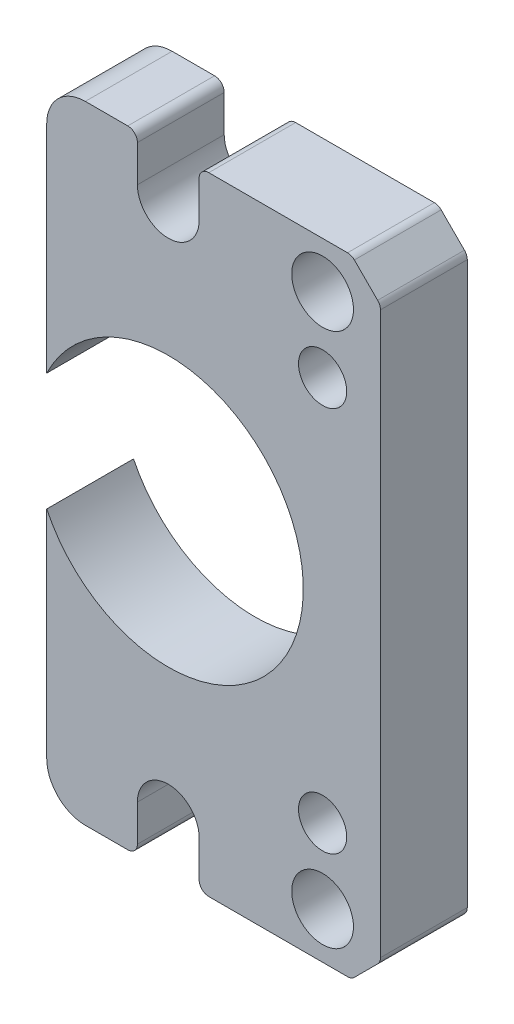
ISO-10303-21;
HEADER;
FILE_DESCRIPTION(('STEP AP214'),'2;1');
FILE_NAME('part.step','',(''),(''),'','','');
FILE_SCHEMA(('AUTOMOTIVE_DESIGN { 1 0 10303 214 1 1 1 1 }'));
ENDSEC;
DATA;
#1=APPLICATION_CONTEXT('core data for automotive mechanical design processes');
#2=APPLICATION_PROTOCOL_DEFINITION('international standard','automotive_design',2000,#1);
#3=PRODUCT_CONTEXT('',#1,'mechanical');
#4=PRODUCT('Part','Part','',(#3));
#5=PRODUCT_RELATED_PRODUCT_CATEGORY('part','',(#4));
#6=PRODUCT_DEFINITION_FORMATION('','',#4);
#7=PRODUCT_DEFINITION_CONTEXT('part definition',#1,'design');
#8=PRODUCT_DEFINITION('design','',#6,#7);
#9=PRODUCT_DEFINITION_SHAPE('','',#8);
#10=(LENGTH_UNIT() NAMED_UNIT(*) SI_UNIT(.MILLI.,.METRE.));
#11=(NAMED_UNIT(*) PLANE_ANGLE_UNIT() SI_UNIT($,.RADIAN.));
#12=(NAMED_UNIT(*) SI_UNIT($,.STERADIAN.) SOLID_ANGLE_UNIT());
#13=UNCERTAINTY_MEASURE_WITH_UNIT(LENGTH_MEASURE(1.E-05),#10,'distance_accuracy_value','');
#14=(GEOMETRIC_REPRESENTATION_CONTEXT(3) GLOBAL_UNCERTAINTY_ASSIGNED_CONTEXT((#13)) GLOBAL_UNIT_ASSIGNED_CONTEXT((#10,
#11,#12)) REPRESENTATION_CONTEXT('',''));
#15=CARTESIAN_POINT('',(0.,0.,0.));
#16=DIRECTION('',(0.,0.,1.));
#17=DIRECTION('',(1.,0.,0.));
#18=AXIS2_PLACEMENT_3D('',#15,#16,#17);
#19=CARTESIAN_POINT('',(10.5,-14.5428932188134,0.));
#20=DIRECTION('',(0.,0.,-1.));
#21=DIRECTION('',(-1.,0.,0.));
#22=AXIS2_PLACEMENT_3D('',#19,#20,#21);
#23=CYLINDRICAL_SURFACE('',#22,0.500000000000017);
#24=CARTESIAN_POINT('',(10.5,-14.5428932188134,-4.5));
#25=DIRECTION('',(0.,0.,-1.));
#26=DIRECTION('',(-1.,0.,0.));
#27=AXIS2_PLACEMENT_3D('',#24,#25,#26);
#28=CIRCLE('',#27,0.500000000000017);
#29=CARTESIAN_POINT('',(11.,-14.5428932188134,-4.5));
#30=VERTEX_POINT('',#29);
#31=CARTESIAN_POINT('',(10.8535533905933,-14.8964466094067,-4.5));
#32=VERTEX_POINT('',#31);
#33=EDGE_CURVE('E257',#30,#32,#28,.T.);
#34=ORIENTED_EDGE('',*,*,#33,.F.);
#35=DIRECTION('',(0.,0.,-1.));
#36=VECTOR('',#35,1.);
#37=CARTESIAN_POINT('',(11.,-14.5428932188134,0.));
#38=LINE('',#37,#36);
#39=CARTESIAN_POINT('',(11.,-14.5428932188134,0.));
#40=VERTEX_POINT('',#39);
#41=EDGE_CURVE('E214',#40,#30,#38,.T.);
#42=ORIENTED_EDGE('',*,*,#41,.F.);
#43=CARTESIAN_POINT('',(10.5,-14.5428932188134,0.));
#44=DIRECTION('',(0.,0.,-1.));
#45=DIRECTION('',(-1.,0.,0.));
#46=AXIS2_PLACEMENT_3D('',#43,#44,#45);
#47=CIRCLE('',#46,0.500000000000017);
#48=CARTESIAN_POINT('',(10.8535533905933,-14.8964466094067,0.));
#49=VERTEX_POINT('',#48);
#50=EDGE_CURVE('E260',#40,#49,#47,.T.);
#51=ORIENTED_EDGE('',*,*,#50,.T.);
#52=DIRECTION('',(0.,0.,-1.));
#53=VECTOR('',#52,1.);
#54=CARTESIAN_POINT('',(10.8535533905933,-14.8964466094067,0.));
#55=LINE('',#54,#53);
#56=EDGE_CURVE('E323',#49,#32,#55,.T.);
#57=ORIENTED_EDGE('',*,*,#56,.T.);
#58=EDGE_LOOP('',(#34,#42,#51,#57));
#59=FACE_BOUND('',#58,.T.);
#60=ADVANCED_FACE('F34',(#59),#23,.T.);
#61=CARTESIAN_POINT('',(11.,14.5428932188134,0.));
#62=DIRECTION('',(1.,0.,0.));
#63=DIRECTION('',(0.,0.,-1.));
#64=AXIS2_PLACEMENT_3D('',#61,#62,#63);
#65=PLANE('',#64);
#66=DIRECTION('',(0.,-1.,0.));
#67=VECTOR('',#66,1.);
#68=CARTESIAN_POINT('',(11.,14.5428932188134,-4.5));
#69=LINE('',#68,#67);
#70=CARTESIAN_POINT('',(11.,14.5428932188134,-4.5));
#71=VERTEX_POINT('',#70);
#72=EDGE_CURVE('E264',#71,#30,#69,.T.);
#73=ORIENTED_EDGE('',*,*,#72,.F.);
#74=DIRECTION('',(0.,0.,-1.));
#75=VECTOR('',#74,1.);
#76=CARTESIAN_POINT('',(11.,14.5428932188134,0.));
#77=LINE('',#76,#75);
#78=CARTESIAN_POINT('',(11.,14.5428932188134,0.));
#79=VERTEX_POINT('',#78);
#80=EDGE_CURVE('E385',#79,#71,#77,.T.);
#81=ORIENTED_EDGE('',*,*,#80,.F.);
#82=DIRECTION('',(0.,-1.,0.));
#83=VECTOR('',#82,1.);
#84=CARTESIAN_POINT('',(11.,14.5428932188134,0.));
#85=LINE('',#84,#83);
#86=EDGE_CURVE('E320',#79,#40,#85,.T.);
#87=ORIENTED_EDGE('',*,*,#86,.T.);
#88=ORIENTED_EDGE('',*,*,#41,.T.);
#89=EDGE_LOOP('',(#73,#81,#87,#88));
#90=FACE_BOUND('',#89,.T.);
#91=ADVANCED_FACE('F481',(#90),#65,.T.);
#92=CARTESIAN_POINT('',(10.5,14.5428932188134,0.));
#93=DIRECTION('',(0.,0.,-1.));
#94=DIRECTION('',(-1.,0.,0.));
#95=AXIS2_PLACEMENT_3D('',#92,#93,#94);
#96=CYLINDRICAL_SURFACE('',#95,0.500000000000017);
#97=CARTESIAN_POINT('',(10.5,14.5428932188134,-4.5));
#98=DIRECTION('',(0.,0.,-1.));
#99=DIRECTION('',(-1.,0.,0.));
#100=AXIS2_PLACEMENT_3D('',#97,#98,#99);
#101=CIRCLE('',#100,0.500000000000017);
#102=CARTESIAN_POINT('',(10.8535533905933,14.8964466094067,-4.5));
#103=VERTEX_POINT('',#102);
#104=EDGE_CURVE('E379',#103,#71,#101,.T.);
#105=ORIENTED_EDGE('',*,*,#104,.F.);
#106=DIRECTION('',(0.,0.,-1.));
#107=VECTOR('',#106,1.);
#108=CARTESIAN_POINT('',(10.8535533905933,14.8964466094067,0.));
#109=LINE('',#108,#107);
#110=CARTESIAN_POINT('',(10.8535533905933,14.8964466094067,0.));
#111=VERTEX_POINT('',#110);
#112=EDGE_CURVE('E387',#111,#103,#109,.T.);
#113=ORIENTED_EDGE('',*,*,#112,.F.);
#114=CARTESIAN_POINT('',(10.5,14.5428932188134,0.));
#115=DIRECTION('',(0.,0.,-1.));
#116=DIRECTION('',(-1.,0.,0.));
#117=AXIS2_PLACEMENT_3D('',#114,#115,#116);
#118=CIRCLE('',#117,0.500000000000017);
#119=EDGE_CURVE('E317',#111,#79,#118,.T.);
#120=ORIENTED_EDGE('',*,*,#119,.T.);
#121=ORIENTED_EDGE('',*,*,#80,.T.);
#122=EDGE_LOOP('',(#105,#113,#120,#121));
#123=FACE_BOUND('',#122,.T.);
#124=ADVANCED_FACE('F478',(#123),#96,.T.);
#125=CARTESIAN_POINT('',(9.64644660940672,16.1035533905933,0.));
#126=DIRECTION('',(0.707106781186554,0.707106781186541,0.));
#127=DIRECTION('',(-0.707106781186541,0.707106781186554,0.));
#128=AXIS2_PLACEMENT_3D('',#125,#126,#127);
#129=PLANE('',#128);
#130=DIRECTION('',(0.707106781186541,-0.707106781186554,0.));
#131=VECTOR('',#130,1.);
#132=CARTESIAN_POINT('',(9.64644660940672,16.1035533905933,-4.5));
#133=LINE('',#132,#131);
#134=CARTESIAN_POINT('',(9.64644660940672,16.1035533905933,-4.5));
#135=VERTEX_POINT('',#134);
#136=EDGE_CURVE('E376',#135,#103,#133,.T.);
#137=ORIENTED_EDGE('',*,*,#136,.F.);
#138=DIRECTION('',(0.,0.,-1.));
#139=VECTOR('',#138,1.);
#140=CARTESIAN_POINT('',(9.64644660940672,16.1035533905933,0.));
#141=LINE('',#140,#139);
#142=CARTESIAN_POINT('',(9.64644660940672,16.1035533905933,0.));
#143=VERTEX_POINT('',#142);
#144=EDGE_CURVE('E389',#143,#135,#141,.T.);
#145=ORIENTED_EDGE('',*,*,#144,.F.);
#146=DIRECTION('',(0.707106781186541,-0.707106781186554,0.));
#147=VECTOR('',#146,1.);
#148=CARTESIAN_POINT('',(9.64644660940672,16.1035533905933,0.));
#149=LINE('',#148,#147);
#150=EDGE_CURVE('E314',#143,#111,#149,.T.);
#151=ORIENTED_EDGE('',*,*,#150,.T.);
#152=ORIENTED_EDGE('',*,*,#112,.T.);
#153=EDGE_LOOP('',(#137,#145,#151,#152));
#154=FACE_BOUND('',#153,.T.);
#155=ADVANCED_FACE('F474',(#154),#129,.T.);
#156=CARTESIAN_POINT('',(9.29289321881345,15.75,0.));
#157=DIRECTION('',(0.,0.,-1.));
#158=DIRECTION('',(-1.,0.,0.));
#159=AXIS2_PLACEMENT_3D('',#156,#157,#158);
#160=CYLINDRICAL_SURFACE('',#159,0.500000000000008);
#161=CARTESIAN_POINT('',(9.29289321881345,15.75,-4.5));
#162=DIRECTION('',(0.,0.,-1.));
#163=DIRECTION('',(-1.,0.,0.));
#164=AXIS2_PLACEMENT_3D('',#161,#162,#163);
#165=CIRCLE('',#164,0.500000000000008);
#166=CARTESIAN_POINT('',(9.29289321881345,16.25,-4.5));
#167=VERTEX_POINT('',#166);
#168=EDGE_CURVE('E373',#167,#135,#165,.T.);
#169=ORIENTED_EDGE('',*,*,#168,.F.);
#170=DIRECTION('',(0.,0.,-1.));
#171=VECTOR('',#170,1.);
#172=CARTESIAN_POINT('',(9.29289321881345,16.25,0.));
#173=LINE('',#172,#171);
#174=CARTESIAN_POINT('',(9.29289321881345,16.25,0.));
#175=VERTEX_POINT('',#174);
#176=EDGE_CURVE('E391',#175,#167,#173,.T.);
#177=ORIENTED_EDGE('',*,*,#176,.F.);
#178=CARTESIAN_POINT('',(9.29289321881345,15.75,0.));
#179=DIRECTION('',(0.,0.,-1.));
#180=DIRECTION('',(-1.,0.,0.));
#181=AXIS2_PLACEMENT_3D('',#178,#179,#180);
#182=CIRCLE('',#181,0.500000000000008);
#183=EDGE_CURVE('E311',#175,#143,#182,.T.);
#184=ORIENTED_EDGE('',*,*,#183,.T.);
#185=ORIENTED_EDGE('',*,*,#144,.T.);
#186=EDGE_LOOP('',(#169,#177,#184,#185));
#187=FACE_BOUND('',#186,.T.);
#188=ADVANCED_FACE('F469',(#187),#160,.T.);
#189=CARTESIAN_POINT('',(2.1,16.25,0.));
#190=DIRECTION('',(0.,1.,0.));
#191=DIRECTION('',(0.,0.,1.));
#192=AXIS2_PLACEMENT_3D('',#189,#190,#191);
#193=PLANE('',#192);
#194=DIRECTION('',(1.,0.,0.));
#195=VECTOR('',#194,1.);
#196=CARTESIAN_POINT('',(2.1,16.25,-4.5));
#197=LINE('',#196,#195);
#198=CARTESIAN_POINT('',(2.1,16.25,-4.5));
#199=VERTEX_POINT('',#198);
#200=EDGE_CURVE('E370',#199,#167,#197,.T.);
#201=ORIENTED_EDGE('',*,*,#200,.F.);
#202=DIRECTION('',(0.,0.,-1.));
#203=VECTOR('',#202,1.);
#204=CARTESIAN_POINT('',(2.1,16.25,0.));
#205=LINE('',#204,#203);
#206=CARTESIAN_POINT('',(2.1,16.25,0.));
#207=VERTEX_POINT('',#206);
#208=EDGE_CURVE('E393',#207,#199,#205,.T.);
#209=ORIENTED_EDGE('',*,*,#208,.F.);
#210=DIRECTION('',(1.,0.,0.));
#211=VECTOR('',#210,1.);
#212=CARTESIAN_POINT('',(2.1,16.25,0.));
#213=LINE('',#212,#211);
#214=EDGE_CURVE('E308',#207,#175,#213,.T.);
#215=ORIENTED_EDGE('',*,*,#214,.T.);
#216=ORIENTED_EDGE('',*,*,#176,.T.);
#217=EDGE_LOOP('',(#201,#209,#215,#216));
#218=FACE_BOUND('',#217,.T.);
#219=ADVANCED_FACE('F465',(#218),#193,.T.);
#220=CARTESIAN_POINT('',(2.1,15.75,0.));
#221=DIRECTION('',(0.,0.,-1.));
#222=DIRECTION('',(-1.,0.,0.));
#223=AXIS2_PLACEMENT_3D('',#220,#221,#222);
#224=CYLINDRICAL_SURFACE('',#223,0.5);
#225=CARTESIAN_POINT('',(2.1,15.75,-4.5));
#226=DIRECTION('',(0.,0.,-1.));
#227=DIRECTION('',(-1.,0.,0.));
#228=AXIS2_PLACEMENT_3D('',#225,#226,#227);
#229=CIRCLE('',#228,0.5);
#230=CARTESIAN_POINT('',(1.6,15.75,-4.5));
#231=VERTEX_POINT('',#230);
#232=EDGE_CURVE('E367',#231,#199,#229,.T.);
#233=ORIENTED_EDGE('',*,*,#232,.F.);
#234=DIRECTION('',(0.,0.,-1.));
#235=VECTOR('',#234,1.);
#236=CARTESIAN_POINT('',(1.6,15.75,0.));
#237=LINE('',#236,#235);
#238=CARTESIAN_POINT('',(1.6,15.75,0.));
#239=VERTEX_POINT('',#238);
#240=EDGE_CURVE('E395',#239,#231,#237,.T.);
#241=ORIENTED_EDGE('',*,*,#240,.F.);
#242=CARTESIAN_POINT('',(2.1,15.75,0.));
#243=DIRECTION('',(0.,0.,-1.));
#244=DIRECTION('',(-1.,0.,0.));
#245=AXIS2_PLACEMENT_3D('',#242,#243,#244);
#246=CIRCLE('',#245,0.5);
#247=EDGE_CURVE('E305',#239,#207,#246,.T.);
#248=ORIENTED_EDGE('',*,*,#247,.T.);
#249=ORIENTED_EDGE('',*,*,#208,.T.);
#250=EDGE_LOOP('',(#233,#241,#248,#249));
#251=FACE_BOUND('',#250,.T.);
#252=ADVANCED_FACE('F461',(#251),#224,.T.);
#253=CARTESIAN_POINT('',(1.6,13.856406460551,0.));
#254=DIRECTION('',(-1.,0.,0.));
#255=DIRECTION('',(0.,0.,1.));
#256=AXIS2_PLACEMENT_3D('',#253,#254,#255);
#257=PLANE('',#256);
#258=DIRECTION('',(0.,1.,0.));
#259=VECTOR('',#258,1.);
#260=CARTESIAN_POINT('',(1.6,13.856406460551,-4.5));
#261=LINE('',#260,#259);
#262=CARTESIAN_POINT('',(1.6,13.856406460551,-4.5));
#263=VERTEX_POINT('',#262);
#264=EDGE_CURVE('E364',#263,#231,#261,.T.);
#265=ORIENTED_EDGE('',*,*,#264,.F.);
#266=DIRECTION('',(0.,0.,-1.));
#267=VECTOR('',#266,1.);
#268=CARTESIAN_POINT('',(1.6,13.856406460551,0.));
#269=LINE('',#268,#267);
#270=CARTESIAN_POINT('',(1.6,13.856406460551,0.));
#271=VERTEX_POINT('',#270);
#272=EDGE_CURVE('E397',#271,#263,#269,.T.);
#273=ORIENTED_EDGE('',*,*,#272,.F.);
#274=DIRECTION('',(0.,1.,0.));
#275=VECTOR('',#274,1.);
#276=CARTESIAN_POINT('',(1.6,13.856406460551,0.));
#277=LINE('',#276,#275);
#278=EDGE_CURVE('E302',#271,#239,#277,.T.);
#279=ORIENTED_EDGE('',*,*,#278,.T.);
#280=ORIENTED_EDGE('',*,*,#240,.T.);
#281=EDGE_LOOP('',(#265,#273,#279,#280));
#282=FACE_BOUND('',#281,.T.);
#283=ADVANCED_FACE('F457',(#282),#257,.T.);
#284=CARTESIAN_POINT('',(0.,13.856406460551,0.));
#285=DIRECTION('',(0.,0.,-1.));
#286=DIRECTION('',(-1.,0.,0.));
#287=AXIS2_PLACEMENT_3D('',#284,#285,#286);
#288=CYLINDRICAL_SURFACE('',#287,1.6);
#289=CARTESIAN_POINT('',(0.,13.856406460551,-4.5));
#290=DIRECTION('',(0.,0.,1.));
#291=DIRECTION('',(1.,0.,0.));
#292=AXIS2_PLACEMENT_3D('',#289,#290,#291);
#293=CIRCLE('',#292,1.6);
#294=CARTESIAN_POINT('',(-1.6,13.856406460551,-4.5));
#295=VERTEX_POINT('',#294);
#296=EDGE_CURVE('E361',#295,#263,#293,.T.);
#297=ORIENTED_EDGE('',*,*,#296,.F.);
#298=DIRECTION('',(0.,0.,-1.));
#299=VECTOR('',#298,1.);
#300=CARTESIAN_POINT('',(-1.6,13.856406460551,0.));
#301=LINE('',#300,#299);
#302=CARTESIAN_POINT('',(-1.6,13.856406460551,0.));
#303=VERTEX_POINT('',#302);
#304=EDGE_CURVE('E399',#303,#295,#301,.T.);
#305=ORIENTED_EDGE('',*,*,#304,.F.);
#306=CARTESIAN_POINT('',(0.,13.856406460551,0.));
#307=DIRECTION('',(0.,0.,1.));
#308=DIRECTION('',(1.,0.,0.));
#309=AXIS2_PLACEMENT_3D('',#306,#307,#308);
#310=CIRCLE('',#309,1.6);
#311=EDGE_CURVE('E299',#303,#271,#310,.T.);
#312=ORIENTED_EDGE('',*,*,#311,.T.);
#313=ORIENTED_EDGE('',*,*,#272,.T.);
#314=EDGE_LOOP('',(#297,#305,#312,#313));
#315=FACE_BOUND('',#314,.T.);
#316=ADVANCED_FACE('F453',(#315),#288,.F.);
#317=CARTESIAN_POINT('',(-1.6,15.75,0.));
#318=DIRECTION('',(1.,0.,0.));
#319=DIRECTION('',(0.,0.,-1.));
#320=AXIS2_PLACEMENT_3D('',#317,#318,#319);
#321=PLANE('',#320);
#322=DIRECTION('',(0.,-1.,0.));
#323=VECTOR('',#322,1.);
#324=CARTESIAN_POINT('',(-1.6,15.75,-4.5));
#325=LINE('',#324,#323);
#326=CARTESIAN_POINT('',(-1.6,15.75,-4.5));
#327=VERTEX_POINT('',#326);
#328=EDGE_CURVE('E358',#327,#295,#325,.T.);
#329=ORIENTED_EDGE('',*,*,#328,.F.);
#330=DIRECTION('',(0.,0.,-1.));
#331=VECTOR('',#330,1.);
#332=CARTESIAN_POINT('',(-1.6,15.75,0.));
#333=LINE('',#332,#331);
#334=CARTESIAN_POINT('',(-1.6,15.75,0.));
#335=VERTEX_POINT('',#334);
#336=EDGE_CURVE('E401',#335,#327,#333,.T.);
#337=ORIENTED_EDGE('',*,*,#336,.F.);
#338=DIRECTION('',(0.,-1.,0.));
#339=VECTOR('',#338,1.);
#340=CARTESIAN_POINT('',(-1.6,15.75,0.));
#341=LINE('',#340,#339);
#342=EDGE_CURVE('E296',#335,#303,#341,.T.);
#343=ORIENTED_EDGE('',*,*,#342,.T.);
#344=ORIENTED_EDGE('',*,*,#304,.T.);
#345=EDGE_LOOP('',(#329,#337,#343,#344));
#346=FACE_BOUND('',#345,.T.);
#347=ADVANCED_FACE('F451',(#346),#321,.T.);
#348=CARTESIAN_POINT('',(-2.1,15.75,0.));
#349=DIRECTION('',(0.,0.,-1.));
#350=DIRECTION('',(-1.,0.,0.));
#351=AXIS2_PLACEMENT_3D('',#348,#349,#350);
#352=CYLINDRICAL_SURFACE('',#351,0.5);
#353=CARTESIAN_POINT('',(-2.1,15.75,-4.5));
#354=DIRECTION('',(0.,0.,-1.));
#355=DIRECTION('',(-1.,0.,0.));
#356=AXIS2_PLACEMENT_3D('',#353,#354,#355);
#357=CIRCLE('',#356,0.5);
#358=CARTESIAN_POINT('',(-2.1,16.25,-4.5));
#359=VERTEX_POINT('',#358);
#360=EDGE_CURVE('E355',#359,#327,#357,.T.);
#361=ORIENTED_EDGE('',*,*,#360,.F.);
#362=DIRECTION('',(0.,0.,-1.));
#363=VECTOR('',#362,1.);
#364=CARTESIAN_POINT('',(-2.1,16.25,0.));
#365=LINE('',#364,#363);
#366=CARTESIAN_POINT('',(-2.1,16.25,0.));
#367=VERTEX_POINT('',#366);
#368=EDGE_CURVE('E403',#367,#359,#365,.T.);
#369=ORIENTED_EDGE('',*,*,#368,.F.);
#370=CARTESIAN_POINT('',(-2.1,15.75,0.));
#371=DIRECTION('',(0.,0.,-1.));
#372=DIRECTION('',(-1.,0.,0.));
#373=AXIS2_PLACEMENT_3D('',#370,#371,#372);
#374=CIRCLE('',#373,0.5);
#375=EDGE_CURVE('E293',#367,#335,#374,.T.);
#376=ORIENTED_EDGE('',*,*,#375,.T.);
#377=ORIENTED_EDGE('',*,*,#336,.T.);
#378=EDGE_LOOP('',(#361,#369,#376,#377));
#379=FACE_BOUND('',#378,.T.);
#380=ADVANCED_FACE('F445',(#379),#352,.T.);
#381=CARTESIAN_POINT('',(-9.29289321881346,16.25,0.));
#382=DIRECTION('',(0.,1.,0.));
#383=DIRECTION('',(0.,0.,1.));
#384=AXIS2_PLACEMENT_3D('',#381,#382,#383);
#385=PLANE('',#384);
#386=DIRECTION('',(1.,0.,0.));
#387=VECTOR('',#386,1.);
#388=CARTESIAN_POINT('',(-9.29289321881346,16.25,-4.5));
#389=LINE('',#388,#387);
#390=CARTESIAN_POINT('',(-4.30090089148444,16.25,-4.5));
#391=VERTEX_POINT('',#390);
#392=EDGE_CURVE('E353',#391,#359,#389,.T.);
#393=ORIENTED_EDGE('',*,*,#392,.F.);
#394=DIRECTION('',(0.,0.,1.));
#395=VECTOR('',#394,1.);
#396=CARTESIAN_POINT('',(-4.30090089148444,16.25,0.));
#397=LINE('',#396,#395);
#398=CARTESIAN_POINT('',(-4.30090089148444,16.25,0.));
#399=VERTEX_POINT('',#398);
#400=EDGE_CURVE('E42',#391,#399,#397,.T.);
#401=ORIENTED_EDGE('',*,*,#400,.T.);
#402=DIRECTION('',(1.,0.,0.));
#403=VECTOR('',#402,1.);
#404=CARTESIAN_POINT('',(-9.29289321881346,16.25,0.));
#405=LINE('',#404,#403);
#406=EDGE_CURVE('E291',#399,#367,#405,.T.);
#407=ORIENTED_EDGE('',*,*,#406,.T.);
#408=ORIENTED_EDGE('',*,*,#368,.T.);
#409=EDGE_LOOP('',(#393,#401,#407,#408));
#410=FACE_BOUND('',#409,.T.);
#411=ADVANCED_FACE('F437',(#410),#385,.T.);
#412=CARTESIAN_POINT('',(-2.1,-16.25,0.));
#413=DIRECTION('',(0.,-1.,0.));
#414=DIRECTION('',(0.,0.,-1.));
#415=AXIS2_PLACEMENT_3D('',#412,#413,#414);
#416=PLANE('',#415);
#417=DIRECTION('',(-1.,0.,0.));
#418=VECTOR('',#417,1.);
#419=CARTESIAN_POINT('',(-2.1,-16.25,0.));
#420=LINE('',#419,#418);
#421=CARTESIAN_POINT('',(-2.1,-16.25,0.));
#422=VERTEX_POINT('',#421);
#423=CARTESIAN_POINT('',(-4.30090089148444,-16.25,0.));
#424=VERTEX_POINT('',#423);
#425=EDGE_CURVE('E288',#422,#424,#420,.T.);
#426=ORIENTED_EDGE('',*,*,#425,.T.);
#427=DIRECTION('',(0.,0.,1.));
#428=VECTOR('',#427,1.);
#429=CARTESIAN_POINT('',(-4.30090089148444,-16.25,-4.5));
#430=LINE('',#429,#428);
#431=CARTESIAN_POINT('',(-4.30090089148444,-16.25,-4.5));
#432=VERTEX_POINT('',#431);
#433=EDGE_CURVE('E430',#424,#432,#430,.F.);
#434=ORIENTED_EDGE('',*,*,#433,.T.);
#435=DIRECTION('',(-1.,0.,0.));
#436=VECTOR('',#435,1.);
#437=CARTESIAN_POINT('',(-2.1,-16.25,-4.5));
#438=LINE('',#437,#436);
#439=CARTESIAN_POINT('',(-2.1,-16.25,-4.5));
#440=VERTEX_POINT('',#439);
#441=EDGE_CURVE('E350',#440,#432,#438,.T.);
#442=ORIENTED_EDGE('',*,*,#441,.F.);
#443=DIRECTION('',(0.,0.,-1.));
#444=VECTOR('',#443,1.);
#445=CARTESIAN_POINT('',(-2.1,-16.25,0.));
#446=LINE('',#445,#444);
#447=EDGE_CURVE('E406',#422,#440,#446,.T.);
#448=ORIENTED_EDGE('',*,*,#447,.F.);
#449=EDGE_LOOP('',(#426,#434,#442,#448));
#450=FACE_BOUND('',#449,.T.);
#451=ADVANCED_FACE('F555',(#450),#416,.T.);
#452=CARTESIAN_POINT('',(-2.1,-15.75,0.));
#453=DIRECTION('',(0.,0.,-1.));
#454=DIRECTION('',(-1.,0.,0.));
#455=AXIS2_PLACEMENT_3D('',#452,#453,#454);
#456=CYLINDRICAL_SURFACE('',#455,0.5);
#457=CARTESIAN_POINT('',(-2.1,-15.75,-4.5));
#458=DIRECTION('',(0.,0.,-1.));
#459=DIRECTION('',(-1.,0.,0.));
#460=AXIS2_PLACEMENT_3D('',#457,#458,#459);
#461=CIRCLE('',#460,0.5);
#462=CARTESIAN_POINT('',(-1.6,-15.75,-4.5));
#463=VERTEX_POINT('',#462);
#464=EDGE_CURVE('E347',#463,#440,#461,.T.);
#465=ORIENTED_EDGE('',*,*,#464,.F.);
#466=DIRECTION('',(0.,0.,-1.));
#467=VECTOR('',#466,1.);
#468=CARTESIAN_POINT('',(-1.6,-15.75,0.));
#469=LINE('',#468,#467);
#470=CARTESIAN_POINT('',(-1.6,-15.75,0.));
#471=VERTEX_POINT('',#470);
#472=EDGE_CURVE('E408',#471,#463,#469,.T.);
#473=ORIENTED_EDGE('',*,*,#472,.F.);
#474=CARTESIAN_POINT('',(-2.1,-15.75,0.));
#475=DIRECTION('',(0.,0.,-1.));
#476=DIRECTION('',(-1.,0.,0.));
#477=AXIS2_PLACEMENT_3D('',#474,#475,#476);
#478=CIRCLE('',#477,0.5);
#479=EDGE_CURVE('E285',#471,#422,#478,.T.);
#480=ORIENTED_EDGE('',*,*,#479,.T.);
#481=ORIENTED_EDGE('',*,*,#447,.T.);
#482=EDGE_LOOP('',(#465,#473,#480,#481));
#483=FACE_BOUND('',#482,.T.);
#484=ADVANCED_FACE('F516',(#483),#456,.T.);
#485=CARTESIAN_POINT('',(-1.6,-13.856406460551,0.));
#486=DIRECTION('',(1.,0.,0.));
#487=DIRECTION('',(0.,0.,-1.));
#488=AXIS2_PLACEMENT_3D('',#485,#486,#487);
#489=PLANE('',#488);
#490=DIRECTION('',(0.,-1.,0.));
#491=VECTOR('',#490,1.);
#492=CARTESIAN_POINT('',(-1.6,-13.856406460551,-4.5));
#493=LINE('',#492,#491);
#494=CARTESIAN_POINT('',(-1.6,-13.856406460551,-4.5));
#495=VERTEX_POINT('',#494);
#496=EDGE_CURVE('E344',#495,#463,#493,.T.);
#497=ORIENTED_EDGE('',*,*,#496,.F.);
#498=DIRECTION('',(0.,0.,-1.));
#499=VECTOR('',#498,1.);
#500=CARTESIAN_POINT('',(-1.6,-13.856406460551,0.));
#501=LINE('',#500,#499);
#502=CARTESIAN_POINT('',(-1.6,-13.856406460551,0.));
#503=VERTEX_POINT('',#502);
#504=EDGE_CURVE('E410',#503,#495,#501,.T.);
#505=ORIENTED_EDGE('',*,*,#504,.F.);
#506=DIRECTION('',(0.,-1.,0.));
#507=VECTOR('',#506,1.);
#508=CARTESIAN_POINT('',(-1.6,-13.856406460551,0.));
#509=LINE('',#508,#507);
#510=EDGE_CURVE('E282',#503,#471,#509,.T.);
#511=ORIENTED_EDGE('',*,*,#510,.T.);
#512=ORIENTED_EDGE('',*,*,#472,.T.);
#513=EDGE_LOOP('',(#497,#505,#511,#512));
#514=FACE_BOUND('',#513,.T.);
#515=ADVANCED_FACE('F512',(#514),#489,.T.);
#516=CARTESIAN_POINT('',(0.,-13.856406460551,0.));
#517=DIRECTION('',(0.,0.,-1.));
#518=DIRECTION('',(-1.,0.,0.));
#519=AXIS2_PLACEMENT_3D('',#516,#517,#518);
#520=CYLINDRICAL_SURFACE('',#519,1.6);
#521=CARTESIAN_POINT('',(0.,-13.856406460551,-4.5));
#522=DIRECTION('',(0.,0.,1.));
#523=DIRECTION('',(1.,0.,0.));
#524=AXIS2_PLACEMENT_3D('',#521,#522,#523);
#525=CIRCLE('',#524,1.6);
#526=CARTESIAN_POINT('',(1.6,-13.856406460551,-4.5));
#527=VERTEX_POINT('',#526);
#528=EDGE_CURVE('E341',#527,#495,#525,.T.);
#529=ORIENTED_EDGE('',*,*,#528,.F.);
#530=DIRECTION('',(0.,0.,-1.));
#531=VECTOR('',#530,1.);
#532=CARTESIAN_POINT('',(1.6,-13.856406460551,0.));
#533=LINE('',#532,#531);
#534=CARTESIAN_POINT('',(1.6,-13.856406460551,0.));
#535=VERTEX_POINT('',#534);
#536=EDGE_CURVE('E412',#535,#527,#533,.T.);
#537=ORIENTED_EDGE('',*,*,#536,.F.);
#538=CARTESIAN_POINT('',(0.,-13.856406460551,0.));
#539=DIRECTION('',(0.,0.,1.));
#540=DIRECTION('',(1.,0.,0.));
#541=AXIS2_PLACEMENT_3D('',#538,#539,#540);
#542=CIRCLE('',#541,1.6);
#543=EDGE_CURVE('E279',#535,#503,#542,.T.);
#544=ORIENTED_EDGE('',*,*,#543,.T.);
#545=ORIENTED_EDGE('',*,*,#504,.T.);
#546=EDGE_LOOP('',(#529,#537,#544,#545));
#547=FACE_BOUND('',#546,.T.);
#548=ADVANCED_FACE('F508',(#547),#520,.F.);
#549=CARTESIAN_POINT('',(1.6,-15.75,0.));
#550=DIRECTION('',(-1.,0.,0.));
#551=DIRECTION('',(0.,0.,1.));
#552=AXIS2_PLACEMENT_3D('',#549,#550,#551);
#553=PLANE('',#552);
#554=DIRECTION('',(0.,1.,0.));
#555=VECTOR('',#554,1.);
#556=CARTESIAN_POINT('',(1.6,-15.75,-4.5));
#557=LINE('',#556,#555);
#558=CARTESIAN_POINT('',(1.6,-15.75,-4.5));
#559=VERTEX_POINT('',#558);
#560=EDGE_CURVE('E338',#559,#527,#557,.T.);
#561=ORIENTED_EDGE('',*,*,#560,.F.);
#562=DIRECTION('',(0.,0.,-1.));
#563=VECTOR('',#562,1.);
#564=CARTESIAN_POINT('',(1.6,-15.75,0.));
#565=LINE('',#564,#563);
#566=CARTESIAN_POINT('',(1.6,-15.75,0.));
#567=VERTEX_POINT('',#566);
#568=EDGE_CURVE('E414',#567,#559,#565,.T.);
#569=ORIENTED_EDGE('',*,*,#568,.F.);
#570=DIRECTION('',(0.,1.,0.));
#571=VECTOR('',#570,1.);
#572=CARTESIAN_POINT('',(1.6,-15.75,0.));
#573=LINE('',#572,#571);
#574=EDGE_CURVE('E276',#567,#535,#573,.T.);
#575=ORIENTED_EDGE('',*,*,#574,.T.);
#576=ORIENTED_EDGE('',*,*,#536,.T.);
#577=EDGE_LOOP('',(#561,#569,#575,#576));
#578=FACE_BOUND('',#577,.T.);
#579=ADVANCED_FACE('F504',(#578),#553,.T.);
#580=CARTESIAN_POINT('',(2.1,-15.75,0.));
#581=DIRECTION('',(0.,0.,-1.));
#582=DIRECTION('',(-1.,0.,0.));
#583=AXIS2_PLACEMENT_3D('',#580,#581,#582);
#584=CYLINDRICAL_SURFACE('',#583,0.5);
#585=CARTESIAN_POINT('',(2.1,-15.75,-4.5));
#586=DIRECTION('',(0.,0.,-1.));
#587=DIRECTION('',(-1.,0.,0.));
#588=AXIS2_PLACEMENT_3D('',#585,#586,#587);
#589=CIRCLE('',#588,0.5);
#590=CARTESIAN_POINT('',(2.1,-16.25,-4.5));
#591=VERTEX_POINT('',#590);
#592=EDGE_CURVE('E335',#591,#559,#589,.T.);
#593=ORIENTED_EDGE('',*,*,#592,.F.);
#594=DIRECTION('',(0.,0.,-1.));
#595=VECTOR('',#594,1.);
#596=CARTESIAN_POINT('',(2.1,-16.25,0.));
#597=LINE('',#596,#595);
#598=CARTESIAN_POINT('',(2.1,-16.25,0.));
#599=VERTEX_POINT('',#598);
#600=EDGE_CURVE('E416',#599,#591,#597,.T.);
#601=ORIENTED_EDGE('',*,*,#600,.F.);
#602=CARTESIAN_POINT('',(2.1,-15.75,0.));
#603=DIRECTION('',(0.,0.,-1.));
#604=DIRECTION('',(-1.,0.,0.));
#605=AXIS2_PLACEMENT_3D('',#602,#603,#604);
#606=CIRCLE('',#605,0.5);
#607=EDGE_CURVE('E273',#599,#567,#606,.T.);
#608=ORIENTED_EDGE('',*,*,#607,.T.);
#609=ORIENTED_EDGE('',*,*,#568,.T.);
#610=EDGE_LOOP('',(#593,#601,#608,#609));
#611=FACE_BOUND('',#610,.T.);
#612=ADVANCED_FACE('F500',(#611),#584,.T.);
#613=CARTESIAN_POINT('',(9.29289321881345,-16.25,0.));
#614=DIRECTION('',(0.,-1.,0.));
#615=DIRECTION('',(0.,0.,-1.));
#616=AXIS2_PLACEMENT_3D('',#613,#614,#615);
#617=PLANE('',#616);
#618=DIRECTION('',(-1.,0.,0.));
#619=VECTOR('',#618,1.);
#620=CARTESIAN_POINT('',(9.29289321881345,-16.25,-4.5));
#621=LINE('',#620,#619);
#622=CARTESIAN_POINT('',(9.29289321881345,-16.25,-4.5));
#623=VERTEX_POINT('',#622);
#624=EDGE_CURVE('E332',#623,#591,#621,.T.);
#625=ORIENTED_EDGE('',*,*,#624,.F.);
#626=DIRECTION('',(0.,0.,-1.));
#627=VECTOR('',#626,1.);
#628=CARTESIAN_POINT('',(9.29289321881345,-16.25,0.));
#629=LINE('',#628,#627);
#630=CARTESIAN_POINT('',(9.29289321881345,-16.25,0.));
#631=VERTEX_POINT('',#630);
#632=EDGE_CURVE('E418',#631,#623,#629,.T.);
#633=ORIENTED_EDGE('',*,*,#632,.F.);
#634=DIRECTION('',(-1.,0.,0.));
#635=VECTOR('',#634,1.);
#636=CARTESIAN_POINT('',(9.29289321881345,-16.25,0.));
#637=LINE('',#636,#635);
#638=EDGE_CURVE('E270',#631,#599,#637,.T.);
#639=ORIENTED_EDGE('',*,*,#638,.T.);
#640=ORIENTED_EDGE('',*,*,#600,.T.);
#641=EDGE_LOOP('',(#625,#633,#639,#640));
#642=FACE_BOUND('',#641,.T.);
#643=ADVANCED_FACE('F496',(#642),#617,.T.);
#644=CARTESIAN_POINT('',(9.29289321881345,-15.75,0.));
#645=DIRECTION('',(0.,0.,-1.));
#646=DIRECTION('',(-1.,0.,0.));
#647=AXIS2_PLACEMENT_3D('',#644,#645,#646);
#648=CYLINDRICAL_SURFACE('',#647,0.500000000000012);
#649=CARTESIAN_POINT('',(9.29289321881345,-15.75,-4.5));
#650=DIRECTION('',(0.,0.,-1.));
#651=DIRECTION('',(-1.,0.,0.));
#652=AXIS2_PLACEMENT_3D('',#649,#650,#651);
#653=CIRCLE('',#652,0.500000000000012);
#654=CARTESIAN_POINT('',(9.64644660940673,-16.1035533905933,-4.5));
#655=VERTEX_POINT('',#654);
#656=EDGE_CURVE('E329',#655,#623,#653,.T.);
#657=ORIENTED_EDGE('',*,*,#656,.F.);
#658=DIRECTION('',(0.,0.,-1.));
#659=VECTOR('',#658,1.);
#660=CARTESIAN_POINT('',(9.64644660940673,-16.1035533905933,0.));
#661=LINE('',#660,#659);
#662=CARTESIAN_POINT('',(9.64644660940673,-16.1035533905933,0.));
#663=VERTEX_POINT('',#662);
#664=EDGE_CURVE('E420',#663,#655,#661,.T.);
#665=ORIENTED_EDGE('',*,*,#664,.F.);
#666=CARTESIAN_POINT('',(9.29289321881345,-15.75,0.));
#667=DIRECTION('',(0.,0.,-1.));
#668=DIRECTION('',(-1.,0.,0.));
#669=AXIS2_PLACEMENT_3D('',#666,#667,#668);
#670=CIRCLE('',#669,0.500000000000012);
#671=EDGE_CURVE('E267',#663,#631,#670,.T.);
#672=ORIENTED_EDGE('',*,*,#671,.T.);
#673=ORIENTED_EDGE('',*,*,#632,.T.);
#674=EDGE_LOOP('',(#657,#665,#672,#673));
#675=FACE_BOUND('',#674,.T.);
#676=ADVANCED_FACE('F492',(#675),#648,.T.);
#677=CARTESIAN_POINT('',(10.8535533905933,-14.8964466094067,0.));
#678=DIRECTION('',(0.707106781186557,-0.707106781186538,0.));
#679=DIRECTION('',(0.707106781186538,0.707106781186557,0.));
#680=AXIS2_PLACEMENT_3D('',#677,#678,#679);
#681=PLANE('',#680);
#682=DIRECTION('',(-0.707106781186538,-0.707106781186557,0.));
#683=VECTOR('',#682,1.);
#684=CARTESIAN_POINT('',(10.8535533905933,-14.8964466094067,-4.5));
#685=LINE('',#684,#683);
#686=EDGE_CURVE('E326',#32,#655,#685,.T.);
#687=ORIENTED_EDGE('',*,*,#686,.F.);
#688=ORIENTED_EDGE('',*,*,#56,.F.);
#689=DIRECTION('',(-0.707106781186538,-0.707106781186557,0.));
#690=VECTOR('',#689,1.);
#691=CARTESIAN_POINT('',(10.8535533905933,-14.8964466094067,0.));
#692=LINE('',#691,#690);
#693=EDGE_CURVE('E263',#49,#663,#692,.T.);
#694=ORIENTED_EDGE('',*,*,#693,.T.);
#695=ORIENTED_EDGE('',*,*,#664,.T.);
#696=EDGE_LOOP('',(#687,#688,#694,#695));
#697=FACE_BOUND('',#696,.T.);
#698=ADVANCED_FACE('F488',(#697),#681,.T.);
#699=CARTESIAN_POINT('',(10.5,-14.5428932188134,0.));
#700=DIRECTION('',(0.,0.,-1.));
#701=DIRECTION('',(-1.,0.,0.));
#702=AXIS2_PLACEMENT_3D('',#699,#700,#701);
#703=PLANE('',#702);
#704=DIRECTION('',(0.,1.,0.));
#705=VECTOR('',#704,1.);
#706=CARTESIAN_POINT('',(-6.30090089148444,-16.25,0.));
#707=LINE('',#706,#705);
#708=CARTESIAN_POINT('',(-6.30090089148444,-14.25,0.));
#709=VERTEX_POINT('',#708);
#710=CARTESIAN_POINT('',(-6.30090089148444,-3.0493684519406,0.));
#711=VERTEX_POINT('',#710);
#712=EDGE_CURVE('E224',#709,#711,#707,.T.);
#713=ORIENTED_EDGE('',*,*,#712,.F.);
#714=CARTESIAN_POINT('',(-4.30090089148444,-14.25,0.));
#715=DIRECTION('',(0.,0.,-1.));
#716=DIRECTION('',(-1.,0.,0.));
#717=AXIS2_PLACEMENT_3D('',#714,#715,#716);
#718=CIRCLE('',#717,2.);
#719=EDGE_CURVE('E428',#709,#424,#718,.F.);
#720=ORIENTED_EDGE('',*,*,#719,.T.);
#721=ORIENTED_EDGE('',*,*,#425,.F.);
#722=ORIENTED_EDGE('',*,*,#479,.F.);
#723=ORIENTED_EDGE('',*,*,#510,.F.);
#724=ORIENTED_EDGE('',*,*,#543,.F.);
#725=ORIENTED_EDGE('',*,*,#574,.F.);
#726=ORIENTED_EDGE('',*,*,#607,.F.);
#727=ORIENTED_EDGE('',*,*,#638,.F.);
#728=ORIENTED_EDGE('',*,*,#671,.F.);
#729=ORIENTED_EDGE('',*,*,#693,.F.);
#730=ORIENTED_EDGE('',*,*,#50,.F.);
#731=ORIENTED_EDGE('',*,*,#86,.F.);
#732=ORIENTED_EDGE('',*,*,#119,.F.);
#733=ORIENTED_EDGE('',*,*,#150,.F.);
#734=ORIENTED_EDGE('',*,*,#183,.F.);
#735=ORIENTED_EDGE('',*,*,#214,.F.);
#736=ORIENTED_EDGE('',*,*,#247,.F.);
#737=ORIENTED_EDGE('',*,*,#278,.F.);
#738=ORIENTED_EDGE('',*,*,#311,.F.);
#739=ORIENTED_EDGE('',*,*,#342,.F.);
#740=ORIENTED_EDGE('',*,*,#375,.F.);
#741=ORIENTED_EDGE('',*,*,#406,.F.);
#742=CARTESIAN_POINT('',(-4.30090089148444,14.25,0.));
#743=DIRECTION('',(0.,0.,-1.));
#744=DIRECTION('',(-1.,0.,0.));
#745=AXIS2_PLACEMENT_3D('',#742,#743,#744);
#746=CIRCLE('',#745,2.);
#747=CARTESIAN_POINT('',(-6.30090089148444,14.25,0.));
#748=VERTEX_POINT('',#747);
#749=EDGE_CURVE('E223',#399,#748,#746,.F.);
#750=ORIENTED_EDGE('',*,*,#749,.T.);
#751=CARTESIAN_POINT('',(-6.30090089148444,3.0493684519406,0.));
#752=VERTEX_POINT('',#751);
#753=EDGE_CURVE('E207',#752,#748,#707,.T.);
#754=ORIENTED_EDGE('',*,*,#753,.F.);
#755=CARTESIAN_POINT('',(0.,0.,0.));
#756=DIRECTION('',(0.,0.,-1.));
#757=DIRECTION('',(1.,0.,0.));
#758=AXIS2_PLACEMENT_3D('',#755,#756,#757);
#759=CIRCLE('',#758,7.);
#760=EDGE_CURVE('E221',#752,#711,#759,.T.);
#761=ORIENTED_EDGE('',*,*,#760,.T.);
#762=EDGE_LOOP('',(#713,#720,#721,#722,#723,#724,#725,#726,#727,#728,#729,#730,#731,#732,#733,
#734,#735,#736,#737,#738,#739,#740,#741,#750,#754,#761));
#763=FACE_BOUND('',#762,.T.);
#764=CARTESIAN_POINT('',(8.,13.85640646,0.));
#765=DIRECTION('',(0.,0.,-1.));
#766=DIRECTION('',(1.,0.,0.));
#767=AXIS2_PLACEMENT_3D('',#764,#765,#766);
#768=CIRCLE('',#767,1.6);
#769=CARTESIAN_POINT('',(9.6,13.85640646,0.));
#770=VERTEX_POINT('',#769);
#771=EDGE_CURVE('E233',#770,#770,#768,.T.);
#772=ORIENTED_EDGE('',*,*,#771,.T.);
#773=EDGE_LOOP('',(#772));
#774=FACE_BOUND('',#773,.T.);
#775=CARTESIAN_POINT('',(8.,-13.85640646,0.));
#776=DIRECTION('',(0.,0.,-1.));
#777=DIRECTION('',(1.,0.,0.));
#778=AXIS2_PLACEMENT_3D('',#775,#776,#777);
#779=CIRCLE('',#778,1.6);
#780=CARTESIAN_POINT('',(9.6,-13.85640646,0.));
#781=VERTEX_POINT('',#780);
#782=EDGE_CURVE('E242',#781,#781,#779,.T.);
#783=ORIENTED_EDGE('',*,*,#782,.T.);
#784=EDGE_LOOP('',(#783));
#785=FACE_BOUND('',#784,.T.);
#786=CARTESIAN_POINT('',(8.,10.,0.));
#787=DIRECTION('',(0.,0.,-1.));
#788=DIRECTION('',(1.,0.,0.));
#789=AXIS2_PLACEMENT_3D('',#786,#787,#788);
#790=CIRCLE('',#789,1.25);
#791=CARTESIAN_POINT('',(9.25,10.,0.));
#792=VERTEX_POINT('',#791);
#793=EDGE_CURVE('E248',#792,#792,#790,.T.);
#794=ORIENTED_EDGE('',*,*,#793,.T.);
#795=EDGE_LOOP('',(#794));
#796=FACE_BOUND('',#795,.T.);
#797=CARTESIAN_POINT('',(8.,-10.,0.));
#798=DIRECTION('',(0.,0.,-1.));
#799=DIRECTION('',(1.,0.,0.));
#800=AXIS2_PLACEMENT_3D('',#797,#798,#799);
#801=CIRCLE('',#800,1.25);
#802=CARTESIAN_POINT('',(9.25,-10.,0.));
#803=VERTEX_POINT('',#802);
#804=EDGE_CURVE('E254',#803,#803,#801,.T.);
#805=ORIENTED_EDGE('',*,*,#804,.T.);
#806=EDGE_LOOP('',(#805));
#807=FACE_BOUND('',#806,.T.);
#808=ADVANCED_FACE('F219',(#763,#774,#785,#796,#807),#703,.F.);
#809=CARTESIAN_POINT('',(10.5,-14.5428932188134,-4.5));
#810=DIRECTION('',(0.,0.,-1.));
#811=DIRECTION('',(-1.,0.,0.));
#812=AXIS2_PLACEMENT_3D('',#809,#810,#811);
#813=PLANE('',#812);
#814=ORIENTED_EDGE('',*,*,#441,.T.);
#815=CARTESIAN_POINT('',(-4.30090089148444,-14.25,-4.5));
#816=DIRECTION('',(0.,0.,-1.));
#817=DIRECTION('',(-1.,0.,0.));
#818=AXIS2_PLACEMENT_3D('',#815,#816,#817);
#819=CIRCLE('',#818,2.);
#820=CARTESIAN_POINT('',(-6.30090089148444,-14.25,-4.5));
#821=VERTEX_POINT('',#820);
#822=EDGE_CURVE('E433',#432,#821,#819,.T.);
#823=ORIENTED_EDGE('',*,*,#822,.T.);
#824=DIRECTION('',(0.,1.,0.));
#825=VECTOR('',#824,1.);
#826=CARTESIAN_POINT('',(-6.30090089148444,-16.25,-4.5));
#827=LINE('',#826,#825);
#828=CARTESIAN_POINT('',(-6.30090089148444,-3.0493684519406,-4.5));
#829=VERTEX_POINT('',#828);
#830=EDGE_CURVE('E235',#821,#829,#827,.T.);
#831=ORIENTED_EDGE('',*,*,#830,.T.);
#832=CARTESIAN_POINT('',(0.,0.,-4.5));
#833=DIRECTION('',(0.,0.,-1.));
#834=DIRECTION('',(1.,0.,0.));
#835=AXIS2_PLACEMENT_3D('',#832,#833,#834);
#836=CIRCLE('',#835,7.);
#837=CARTESIAN_POINT('',(-6.30090089148444,3.0493684519406,-4.5));
#838=VERTEX_POINT('',#837);
#839=EDGE_CURVE('E230',#838,#829,#836,.T.);
#840=ORIENTED_EDGE('',*,*,#839,.F.);
#841=CARTESIAN_POINT('',(-6.30090089148444,14.25,-4.5));
#842=VERTEX_POINT('',#841);
#843=EDGE_CURVE('E208',#838,#842,#827,.T.);
#844=ORIENTED_EDGE('',*,*,#843,.T.);
#845=CARTESIAN_POINT('',(-4.30090089148444,14.25,-4.5));
#846=DIRECTION('',(0.,0.,-1.));
#847=DIRECTION('',(-1.,0.,0.));
#848=AXIS2_PLACEMENT_3D('',#845,#846,#847);
#849=CIRCLE('',#848,2.);
#850=EDGE_CURVE('E49',#842,#391,#849,.T.);
#851=ORIENTED_EDGE('',*,*,#850,.T.);
#852=ORIENTED_EDGE('',*,*,#392,.T.);
#853=ORIENTED_EDGE('',*,*,#360,.T.);
#854=ORIENTED_EDGE('',*,*,#328,.T.);
#855=ORIENTED_EDGE('',*,*,#296,.T.);
#856=ORIENTED_EDGE('',*,*,#264,.T.);
#857=ORIENTED_EDGE('',*,*,#232,.T.);
#858=ORIENTED_EDGE('',*,*,#200,.T.);
#859=ORIENTED_EDGE('',*,*,#168,.T.);
#860=ORIENTED_EDGE('',*,*,#136,.T.);
#861=ORIENTED_EDGE('',*,*,#104,.T.);
#862=ORIENTED_EDGE('',*,*,#72,.T.);
#863=ORIENTED_EDGE('',*,*,#33,.T.);
#864=ORIENTED_EDGE('',*,*,#686,.T.);
#865=ORIENTED_EDGE('',*,*,#656,.T.);
#866=ORIENTED_EDGE('',*,*,#624,.T.);
#867=ORIENTED_EDGE('',*,*,#592,.T.);
#868=ORIENTED_EDGE('',*,*,#560,.T.);
#869=ORIENTED_EDGE('',*,*,#528,.T.);
#870=ORIENTED_EDGE('',*,*,#496,.T.);
#871=ORIENTED_EDGE('',*,*,#464,.T.);
#872=EDGE_LOOP('',(#814,#823,#831,#840,#844,#851,#852,#853,#854,#855,#856,#857,#858,#859,#860,
#861,#862,#863,#864,#865,#866,#867,#868,#869,#870,#871));
#873=FACE_BOUND('',#872,.T.);
#874=CARTESIAN_POINT('',(8.,13.85640646,-4.5));
#875=DIRECTION('',(0.,0.,-1.));
#876=DIRECTION('',(1.,0.,0.));
#877=AXIS2_PLACEMENT_3D('',#874,#875,#876);
#878=CIRCLE('',#877,1.6);
#879=CARTESIAN_POINT('',(9.6,13.85640646,-4.5));
#880=VERTEX_POINT('',#879);
#881=EDGE_CURVE('E229',#880,#880,#878,.T.);
#882=ORIENTED_EDGE('',*,*,#881,.F.);
#883=EDGE_LOOP('',(#882));
#884=FACE_BOUND('',#883,.T.);
#885=CARTESIAN_POINT('',(8.,-13.85640646,-4.5));
#886=DIRECTION('',(0.,0.,-1.));
#887=DIRECTION('',(1.,0.,0.));
#888=AXIS2_PLACEMENT_3D('',#885,#886,#887);
#889=CIRCLE('',#888,1.6);
#890=CARTESIAN_POINT('',(9.6,-13.85640646,-4.5));
#891=VERTEX_POINT('',#890);
#892=EDGE_CURVE('E240',#891,#891,#889,.T.);
#893=ORIENTED_EDGE('',*,*,#892,.F.);
#894=EDGE_LOOP('',(#893));
#895=FACE_BOUND('',#894,.T.);
#896=CARTESIAN_POINT('',(8.,10.,-4.5));
#897=DIRECTION('',(0.,0.,-1.));
#898=DIRECTION('',(1.,0.,0.));
#899=AXIS2_PLACEMENT_3D('',#896,#897,#898);
#900=CIRCLE('',#899,1.25);
#901=CARTESIAN_POINT('',(9.25,10.,-4.5));
#902=VERTEX_POINT('',#901);
#903=EDGE_CURVE('E245',#902,#902,#900,.T.);
#904=ORIENTED_EDGE('',*,*,#903,.F.);
#905=EDGE_LOOP('',(#904));
#906=FACE_BOUND('',#905,.T.);
#907=CARTESIAN_POINT('',(8.,-10.,-4.5));
#908=DIRECTION('',(0.,0.,-1.));
#909=DIRECTION('',(1.,0.,0.));
#910=AXIS2_PLACEMENT_3D('',#907,#908,#909);
#911=CIRCLE('',#910,1.25);
#912=CARTESIAN_POINT('',(9.25,-10.,-4.5));
#913=VERTEX_POINT('',#912);
#914=EDGE_CURVE('E251',#913,#913,#911,.T.);
#915=ORIENTED_EDGE('',*,*,#914,.F.);
#916=EDGE_LOOP('',(#915));
#917=FACE_BOUND('',#916,.T.);
#918=ADVANCED_FACE('F447',(#873,#884,#895,#906,#917),#813,.T.);
#919=CARTESIAN_POINT('',(8.,-10.,0.));
#920=DIRECTION('',(0.,0.,-1.));
#921=DIRECTION('',(-1.,0.,0.));
#922=AXIS2_PLACEMENT_3D('',#919,#920,#921);
#923=CYLINDRICAL_SURFACE('',#922,1.25);
#924=ORIENTED_EDGE('',*,*,#804,.F.);
#925=EDGE_LOOP('',(#924));
#926=FACE_BOUND('',#925,.T.);
#927=ORIENTED_EDGE('',*,*,#914,.T.);
#928=EDGE_LOOP('',(#927));
#929=FACE_BOUND('',#928,.T.);
#930=ADVANCED_FACE('F580',(#926,#929),#923,.F.);
#931=CARTESIAN_POINT('',(8.,10.,0.));
#932=DIRECTION('',(0.,0.,-1.));
#933=DIRECTION('',(-1.,0.,0.));
#934=AXIS2_PLACEMENT_3D('',#931,#932,#933);
#935=CYLINDRICAL_SURFACE('',#934,1.25);
#936=ORIENTED_EDGE('',*,*,#793,.F.);
#937=EDGE_LOOP('',(#936));
#938=FACE_BOUND('',#937,.T.);
#939=ORIENTED_EDGE('',*,*,#903,.T.);
#940=EDGE_LOOP('',(#939));
#941=FACE_BOUND('',#940,.T.);
#942=ADVANCED_FACE('F585',(#938,#941),#935,.F.);
#943=CARTESIAN_POINT('',(8.,-13.85640646,0.));
#944=DIRECTION('',(0.,0.,-1.));
#945=DIRECTION('',(-1.,0.,0.));
#946=AXIS2_PLACEMENT_3D('',#943,#944,#945);
#947=CYLINDRICAL_SURFACE('',#946,1.6);
#948=ORIENTED_EDGE('',*,*,#782,.F.);
#949=EDGE_LOOP('',(#948));
#950=FACE_BOUND('',#949,.T.);
#951=ORIENTED_EDGE('',*,*,#892,.T.);
#952=EDGE_LOOP('',(#951));
#953=FACE_BOUND('',#952,.T.);
#954=ADVANCED_FACE('F589',(#950,#953),#947,.F.);
#955=CARTESIAN_POINT('',(8.,13.85640646,0.));
#956=DIRECTION('',(0.,0.,-1.));
#957=DIRECTION('',(-1.,0.,0.));
#958=AXIS2_PLACEMENT_3D('',#955,#956,#957);
#959=CYLINDRICAL_SURFACE('',#958,1.6);
#960=ORIENTED_EDGE('',*,*,#771,.F.);
#961=EDGE_LOOP('',(#960));
#962=FACE_BOUND('',#961,.T.);
#963=ORIENTED_EDGE('',*,*,#881,.T.);
#964=EDGE_LOOP('',(#963));
#965=FACE_BOUND('',#964,.T.);
#966=ADVANCED_FACE('F593',(#962,#965),#959,.F.);
#967=CARTESIAN_POINT('',(0.,0.,0.));
#968=DIRECTION('',(0.,0.,-1.));
#969=DIRECTION('',(-1.,0.,0.));
#970=AXIS2_PLACEMENT_3D('',#967,#968,#969);
#971=CYLINDRICAL_SURFACE('',#970,7.);
#972=ORIENTED_EDGE('',*,*,#839,.T.);
#973=DIRECTION('',(0.,0.,-1.));
#974=VECTOR('',#973,1.);
#975=CARTESIAN_POINT('',(-6.30090089148444,-3.0493684519406,0.));
#976=LINE('',#975,#974);
#977=EDGE_CURVE('E213',#829,#711,#976,.F.);
#978=ORIENTED_EDGE('',*,*,#977,.T.);
#979=ORIENTED_EDGE('',*,*,#760,.F.);
#980=DIRECTION('',(0.,0.,-1.));
#981=VECTOR('',#980,1.);
#982=CARTESIAN_POINT('',(-6.30090089148444,3.0493684519406,0.));
#983=LINE('',#982,#981);
#984=EDGE_CURVE('E204',#752,#838,#983,.T.);
#985=ORIENTED_EDGE('',*,*,#984,.T.);
#986=EDGE_LOOP('',(#972,#978,#979,#985));
#987=FACE_BOUND('',#986,.T.);
#988=ADVANCED_FACE('F227',(#987),#971,.F.);
#989=CARTESIAN_POINT('',(-6.30090089148444,-16.25,-4.5));
#990=DIRECTION('',(1.,0.,0.));
#991=DIRECTION('',(0.,0.,-1.));
#992=AXIS2_PLACEMENT_3D('',#989,#990,#991);
#993=PLANE('',#992);
#994=ORIENTED_EDGE('',*,*,#753,.T.);
#995=DIRECTION('',(0.,0.,1.));
#996=VECTOR('',#995,1.);
#997=CARTESIAN_POINT('',(-6.30090089148444,14.25,-4.5));
#998=LINE('',#997,#996);
#999=EDGE_CURVE('E11',#748,#842,#998,.F.);
#1000=ORIENTED_EDGE('',*,*,#999,.T.);
#1001=ORIENTED_EDGE('',*,*,#843,.F.);
#1002=ORIENTED_EDGE('',*,*,#984,.F.);
#1003=EDGE_LOOP('',(#994,#1000,#1001,#1002));
#1004=FACE_BOUND('',#1003,.T.);
#1005=ADVANCED_FACE('F206',(#1004),#993,.F.);
#1006=ORIENTED_EDGE('',*,*,#830,.F.);
#1007=DIRECTION('',(0.,0.,1.));
#1008=VECTOR('',#1007,1.);
#1009=CARTESIAN_POINT('',(-6.30090089148444,-14.25,0.));
#1010=LINE('',#1009,#1008);
#1011=EDGE_CURVE('E424',#821,#709,#1010,.T.);
#1012=ORIENTED_EDGE('',*,*,#1011,.T.);
#1013=ORIENTED_EDGE('',*,*,#712,.T.);
#1014=ORIENTED_EDGE('',*,*,#977,.F.);
#1015=EDGE_LOOP('',(#1006,#1012,#1013,#1014));
#1016=FACE_BOUND('',#1015,.T.);
#1017=ADVANCED_FACE('F526',(#1016),#993,.F.);
#1018=CARTESIAN_POINT('',(-4.30090089148444,-14.25,-4.5));
#1019=DIRECTION('',(0.,0.,-1.));
#1020=DIRECTION('',(-1.,0.,0.));
#1021=AXIS2_PLACEMENT_3D('',#1018,#1019,#1020);
#1022=CYLINDRICAL_SURFACE('',#1021,2.);
#1023=ORIENTED_EDGE('',*,*,#822,.F.);
#1024=ORIENTED_EDGE('',*,*,#433,.F.);
#1025=ORIENTED_EDGE('',*,*,#719,.F.);
#1026=ORIENTED_EDGE('',*,*,#1011,.F.);
#1027=EDGE_LOOP('',(#1023,#1024,#1025,#1026));
#1028=FACE_BOUND('',#1027,.T.);
#1029=ADVANCED_FACE('F524',(#1028),#1022,.T.);
#1030=CARTESIAN_POINT('',(-4.30090089148444,14.25,0.));
#1031=DIRECTION('',(0.,0.,-1.));
#1032=DIRECTION('',(-1.,0.,0.));
#1033=AXIS2_PLACEMENT_3D('',#1030,#1031,#1032);
#1034=CYLINDRICAL_SURFACE('',#1033,2.);
#1035=ORIENTED_EDGE('',*,*,#850,.F.);
#1036=ORIENTED_EDGE('',*,*,#999,.F.);
#1037=ORIENTED_EDGE('',*,*,#749,.F.);
#1038=ORIENTED_EDGE('',*,*,#400,.F.);
#1039=EDGE_LOOP('',(#1035,#1036,#1037,#1038));
#1040=FACE_BOUND('',#1039,.T.);
#1041=ADVANCED_FACE('F36',(#1040),#1034,.T.);
#1042=CLOSED_SHELL('',(#60,#91,#124,#155,#188,#219,#252,#283,#316,#347,#380,#411,#451,#484,#515,
#548,#579,#612,#643,#676,#698,#808,#918,#930,#942,#954,#966,#988,#1005,#1017,#1029,#1041));
#1043=MANIFOLD_SOLID_BREP('B2',#1042);
#1044=ADVANCED_BREP_SHAPE_REPRESENTATION('',(#18,#1043),#14);
#1045=SHAPE_DEFINITION_REPRESENTATION(#9,#1044);
ENDSEC;
END-ISO-10303-21;
